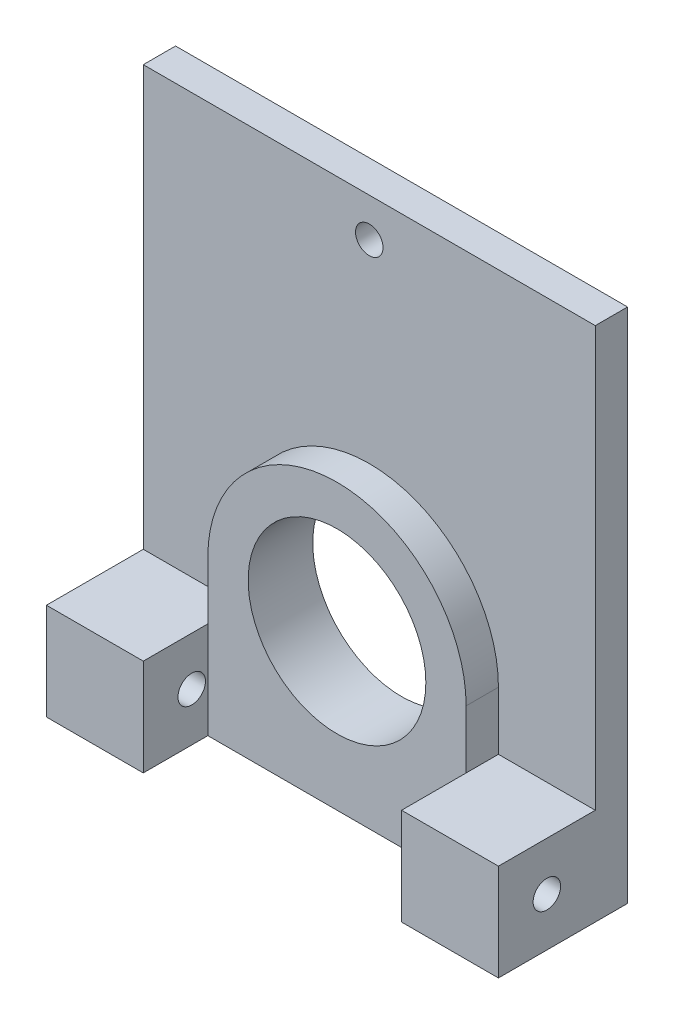
ISO-10303-21;
HEADER;
FILE_DESCRIPTION(('STEP AP214'),'2;1');
FILE_NAME('part.step','',(''),(''),'','','');
FILE_SCHEMA(('AUTOMOTIVE_DESIGN { 1 0 10303 214 1 1 1 1 }'));
ENDSEC;
DATA;
#1=APPLICATION_CONTEXT('core data for automotive mechanical design processes');
#2=APPLICATION_PROTOCOL_DEFINITION('international standard','automotive_design',2000,#1);
#3=PRODUCT_CONTEXT('',#1,'mechanical');
#4=PRODUCT('Part','Part','',(#3));
#5=PRODUCT_RELATED_PRODUCT_CATEGORY('part','',(#4));
#6=PRODUCT_DEFINITION_FORMATION('','',#4);
#7=PRODUCT_DEFINITION_CONTEXT('part definition',#1,'design');
#8=PRODUCT_DEFINITION('design','',#6,#7);
#9=PRODUCT_DEFINITION_SHAPE('','',#8);
#10=(LENGTH_UNIT() NAMED_UNIT(*) SI_UNIT(.MILLI.,.METRE.));
#11=(NAMED_UNIT(*) PLANE_ANGLE_UNIT() SI_UNIT($,.RADIAN.));
#12=(NAMED_UNIT(*) SI_UNIT($,.STERADIAN.) SOLID_ANGLE_UNIT());
#13=UNCERTAINTY_MEASURE_WITH_UNIT(LENGTH_MEASURE(1.E-05),#10,'distance_accuracy_value','');
#14=(GEOMETRIC_REPRESENTATION_CONTEXT(3) GLOBAL_UNCERTAINTY_ASSIGNED_CONTEXT((#13)) GLOBAL_UNIT_ASSIGNED_CONTEXT((#10,
#11,#12)) REPRESENTATION_CONTEXT('',''));
#15=CARTESIAN_POINT('',(0.,0.,0.));
#16=DIRECTION('',(0.,0.,1.));
#17=DIRECTION('',(1.,0.,0.));
#18=AXIS2_PLACEMENT_3D('',#15,#16,#17);
#19=CARTESIAN_POINT('',(0.,0.,3.175));
#20=DIRECTION('',(0.,0.,1.));
#21=DIRECTION('',(1.,0.,0.));
#22=AXIS2_PLACEMENT_3D('',#19,#20,#21);
#23=PLANE('',#22);
#24=CARTESIAN_POINT('',(0.,21.59,3.175));
#25=DIRECTION('',(0.,0.,1.));
#26=DIRECTION('',(1.,0.,0.));
#27=AXIS2_PLACEMENT_3D('',#24,#25,#26);
#28=CIRCLE('',#27,1.35255);
#29=CARTESIAN_POINT('',(1.35255,21.59,3.175));
#30=VERTEX_POINT('',#29);
#31=EDGE_CURVE('E327',#30,#30,#28,.T.);
#32=ORIENTED_EDGE('',*,*,#31,.F.);
#33=EDGE_LOOP('',(#32));
#34=FACE_BOUND('',#33,.T.);
#35=DIRECTION('',(0.,1.,0.));
#36=VECTOR('',#35,1.);
#37=CARTESIAN_POINT('',(12.7,-10.16,3.175));
#38=LINE('',#37,#36);
#39=CARTESIAN_POINT('',(12.7,-15.875,3.175));
#40=VERTEX_POINT('',#39);
#41=CARTESIAN_POINT('',(12.7,-10.16,3.175));
#42=VERTEX_POINT('',#41);
#43=EDGE_CURVE('E60',#40,#42,#38,.T.);
#44=ORIENTED_EDGE('',*,*,#43,.F.);
#45=DIRECTION('',(-1.,0.,0.));
#46=VECTOR('',#45,1.);
#47=CARTESIAN_POINT('',(22.225,-15.875,3.175));
#48=LINE('',#47,#46);
#49=CARTESIAN_POINT('',(22.225,-15.875,3.175));
#50=VERTEX_POINT('',#49);
#51=EDGE_CURVE('E161',#50,#40,#48,.T.);
#52=ORIENTED_EDGE('',*,*,#51,.F.);
#53=DIRECTION('',(0.,1.,0.));
#54=VECTOR('',#53,1.);
#55=CARTESIAN_POINT('',(22.225,25.4,3.175));
#56=LINE('',#55,#54);
#57=CARTESIAN_POINT('',(22.225,25.4,3.175));
#58=VERTEX_POINT('',#57);
#59=EDGE_CURVE('E224',#50,#58,#56,.T.);
#60=ORIENTED_EDGE('',*,*,#59,.T.);
#61=DIRECTION('',(-1.,0.,0.));
#62=VECTOR('',#61,1.);
#63=CARTESIAN_POINT('',(-22.225,25.4,3.175));
#64=LINE('',#63,#62);
#65=CARTESIAN_POINT('',(-22.225,25.4,3.175));
#66=VERTEX_POINT('',#65);
#67=EDGE_CURVE('E226',#58,#66,#64,.T.);
#68=ORIENTED_EDGE('',*,*,#67,.T.);
#69=DIRECTION('',(0.,-1.,0.));
#70=VECTOR('',#69,1.);
#71=CARTESIAN_POINT('',(-22.225,25.4,3.175));
#72=LINE('',#71,#70);
#73=CARTESIAN_POINT('',(-22.225,-15.875,3.175));
#74=VERTEX_POINT('',#73);
#75=EDGE_CURVE('E148',#66,#74,#72,.T.);
#76=ORIENTED_EDGE('',*,*,#75,.T.);
#77=DIRECTION('',(-1.,0.,0.));
#78=VECTOR('',#77,1.);
#79=CARTESIAN_POINT('',(-22.225,-15.875,3.175));
#80=LINE('',#79,#78);
#81=CARTESIAN_POINT('',(-12.7,-15.875,3.175));
#82=VERTEX_POINT('',#81);
#83=EDGE_CURVE('E176',#82,#74,#80,.T.);
#84=ORIENTED_EDGE('',*,*,#83,.F.);
#85=DIRECTION('',(0.,-1.,0.));
#86=VECTOR('',#85,1.);
#87=CARTESIAN_POINT('',(-12.7,-10.16,3.175));
#88=LINE('',#87,#86);
#89=CARTESIAN_POINT('',(-12.7,-10.16,3.175));
#90=VERTEX_POINT('',#89);
#91=EDGE_CURVE('E214',#90,#82,#88,.T.);
#92=ORIENTED_EDGE('',*,*,#91,.F.);
#93=CARTESIAN_POINT('',(0.,-10.16,3.175));
#94=DIRECTION('',(0.,0.,1.));
#95=DIRECTION('',(1.,0.,0.));
#96=AXIS2_PLACEMENT_3D('',#93,#94,#95);
#97=CIRCLE('',#96,12.7);
#98=EDGE_CURVE('E196',#42,#90,#97,.T.);
#99=ORIENTED_EDGE('',*,*,#98,.F.);
#100=EDGE_LOOP('',(#44,#52,#60,#68,#76,#84,#92,#99));
#101=FACE_BOUND('',#100,.T.);
#102=ADVANCED_FACE('F37',(#34,#101),#23,.T.);
#103=CARTESIAN_POINT('',(12.7,-10.16,6.35));
#104=DIRECTION('',(-1.,0.,0.));
#105=DIRECTION('',(0.,-1.,0.));
#106=AXIS2_PLACEMENT_3D('',#103,#104,#105);
#107=PLANE('',#106);
#108=DIRECTION('',(0.,0.,-1.));
#109=VECTOR('',#108,1.);
#110=CARTESIAN_POINT('',(12.7,-15.875,12.7));
#111=LINE('',#110,#109);
#112=CARTESIAN_POINT('',(12.7,-15.875,6.35));
#113=VERTEX_POINT('',#112);
#114=EDGE_CURVE('E173',#113,#40,#111,.T.);
#115=ORIENTED_EDGE('',*,*,#114,.T.);
#116=ORIENTED_EDGE('',*,*,#43,.T.);
#117=DIRECTION('',(0.,0.,-1.));
#118=VECTOR('',#117,1.);
#119=CARTESIAN_POINT('',(12.7,-10.16,6.35));
#120=LINE('',#119,#118);
#121=CARTESIAN_POINT('',(12.7,-10.16,6.35));
#122=VERTEX_POINT('',#121);
#123=EDGE_CURVE('E211',#122,#42,#120,.T.);
#124=ORIENTED_EDGE('',*,*,#123,.F.);
#125=DIRECTION('',(0.,1.,0.));
#126=VECTOR('',#125,1.);
#127=CARTESIAN_POINT('',(12.7,-10.16,6.35));
#128=LINE('',#127,#126);
#129=EDGE_CURVE('E207',#113,#122,#128,.T.);
#130=ORIENTED_EDGE('',*,*,#129,.F.);
#131=EDGE_LOOP('',(#115,#116,#124,#130));
#132=FACE_BOUND('',#131,.T.);
#133=ADVANCED_FACE('F254',(#132),#107,.F.);
#134=CARTESIAN_POINT('',(-12.7,-10.16,6.35));
#135=DIRECTION('',(1.,0.,0.));
#136=DIRECTION('',(0.,1.,0.));
#137=AXIS2_PLACEMENT_3D('',#134,#135,#136);
#138=PLANE('',#137);
#139=DIRECTION('',(0.,0.,-1.));
#140=VECTOR('',#139,1.);
#141=CARTESIAN_POINT('',(-12.7,-15.875,12.7));
#142=LINE('',#141,#140);
#143=CARTESIAN_POINT('',(-12.7,-15.875,6.35));
#144=VERTEX_POINT('',#143);
#145=EDGE_CURVE('E190',#144,#82,#142,.T.);
#146=ORIENTED_EDGE('',*,*,#145,.F.);
#147=DIRECTION('',(0.,-1.,0.));
#148=VECTOR('',#147,1.);
#149=CARTESIAN_POINT('',(-12.7,-10.16,6.35));
#150=LINE('',#149,#148);
#151=CARTESIAN_POINT('',(-12.7,-10.16,6.35));
#152=VERTEX_POINT('',#151);
#153=EDGE_CURVE('E201',#152,#144,#150,.T.);
#154=ORIENTED_EDGE('',*,*,#153,.F.);
#155=DIRECTION('',(0.,0.,-1.));
#156=VECTOR('',#155,1.);
#157=CARTESIAN_POINT('',(-12.7,-10.16,6.35));
#158=LINE('',#157,#156);
#159=EDGE_CURVE('E220',#152,#90,#158,.T.);
#160=ORIENTED_EDGE('',*,*,#159,.T.);
#161=ORIENTED_EDGE('',*,*,#91,.T.);
#162=EDGE_LOOP('',(#146,#154,#160,#161));
#163=FACE_BOUND('',#162,.T.);
#164=ADVANCED_FACE('F276',(#163),#138,.F.);
#165=CARTESIAN_POINT('',(22.225,25.4,3.175));
#166=DIRECTION('',(-1.,0.,0.));
#167=DIRECTION('',(0.,-1.,0.));
#168=AXIS2_PLACEMENT_3D('',#165,#166,#167);
#169=PLANE('',#168);
#170=CARTESIAN_POINT('',(22.225,-20.6375,7.9375));
#171=DIRECTION('',(1.,0.,0.));
#172=DIRECTION('',(0.,0.,-1.));
#173=AXIS2_PLACEMENT_3D('',#170,#171,#172);
#174=CIRCLE('',#173,1.35255);
#175=CARTESIAN_POINT('',(22.225,-20.6375,6.58495000000001));
#176=VERTEX_POINT('',#175);
#177=EDGE_CURVE('E314',#176,#176,#174,.T.);
#178=ORIENTED_EDGE('',*,*,#177,.F.);
#179=EDGE_LOOP('',(#178));
#180=FACE_BOUND('',#179,.T.);
#181=DIRECTION('',(0.,1.,0.));
#182=VECTOR('',#181,1.);
#183=CARTESIAN_POINT('',(22.225,25.4,0.));
#184=LINE('',#183,#182);
#185=CARTESIAN_POINT('',(22.225,-25.4,0.));
#186=VERTEX_POINT('',#185);
#187=CARTESIAN_POINT('',(22.225,25.4,0.));
#188=VERTEX_POINT('',#187);
#189=EDGE_CURVE('E223',#186,#188,#184,.T.);
#190=ORIENTED_EDGE('',*,*,#189,.T.);
#191=DIRECTION('',(0.,0.,-1.));
#192=VECTOR('',#191,1.);
#193=CARTESIAN_POINT('',(22.225,25.4,3.175));
#194=LINE('',#193,#192);
#195=EDGE_CURVE('E11',#58,#188,#194,.T.);
#196=ORIENTED_EDGE('',*,*,#195,.F.);
#197=ORIENTED_EDGE('',*,*,#59,.F.);
#198=DIRECTION('',(0.,0.,-1.));
#199=VECTOR('',#198,1.);
#200=CARTESIAN_POINT('',(22.225,-15.875,12.7));
#201=LINE('',#200,#199);
#202=CARTESIAN_POINT('',(22.225,-15.875,12.7));
#203=VERTEX_POINT('',#202);
#204=EDGE_CURVE('E153',#203,#50,#201,.T.);
#205=ORIENTED_EDGE('',*,*,#204,.F.);
#206=DIRECTION('',(0.,1.,0.));
#207=VECTOR('',#206,1.);
#208=CARTESIAN_POINT('',(22.225,-25.4,12.7));
#209=LINE('',#208,#207);
#210=CARTESIAN_POINT('',(22.225,-25.4,12.7));
#211=VERTEX_POINT('',#210);
#212=EDGE_CURVE('E151',#211,#203,#209,.T.);
#213=ORIENTED_EDGE('',*,*,#212,.F.);
#214=DIRECTION('',(0.,0.,-1.));
#215=VECTOR('',#214,1.);
#216=CARTESIAN_POINT('',(22.225,-25.4,3.175));
#217=LINE('',#216,#215);
#218=EDGE_CURVE('E135',#211,#186,#217,.T.);
#219=ORIENTED_EDGE('',*,*,#218,.T.);
#220=EDGE_LOOP('',(#190,#196,#197,#205,#213,#219));
#221=FACE_BOUND('',#220,.T.);
#222=ADVANCED_FACE('F39',(#180,#221),#169,.F.);
#223=CARTESIAN_POINT('',(-22.225,25.4,3.175));
#224=DIRECTION('',(0.,-1.,0.));
#225=DIRECTION('',(0.,0.,-1.));
#226=AXIS2_PLACEMENT_3D('',#223,#224,#225);
#227=PLANE('',#226);
#228=DIRECTION('',(-1.,0.,0.));
#229=VECTOR('',#228,1.);
#230=CARTESIAN_POINT('',(-22.225,25.4,0.));
#231=LINE('',#230,#229);
#232=CARTESIAN_POINT('',(-22.225,25.4,0.));
#233=VERTEX_POINT('',#232);
#234=EDGE_CURVE('E231',#188,#233,#231,.T.);
#235=ORIENTED_EDGE('',*,*,#234,.T.);
#236=DIRECTION('',(0.,0.,-1.));
#237=VECTOR('',#236,1.);
#238=CARTESIAN_POINT('',(-22.225,25.4,3.175));
#239=LINE('',#238,#237);
#240=EDGE_CURVE('E45',#66,#233,#239,.T.);
#241=ORIENTED_EDGE('',*,*,#240,.F.);
#242=ORIENTED_EDGE('',*,*,#67,.F.);
#243=ORIENTED_EDGE('',*,*,#195,.T.);
#244=EDGE_LOOP('',(#235,#241,#242,#243));
#245=FACE_BOUND('',#244,.T.);
#246=ADVANCED_FACE('F247',(#245),#227,.F.);
#247=CARTESIAN_POINT('',(-22.225,25.4,3.175));
#248=DIRECTION('',(1.,0.,0.));
#249=DIRECTION('',(0.,1.,0.));
#250=AXIS2_PLACEMENT_3D('',#247,#248,#249);
#251=PLANE('',#250);
#252=CARTESIAN_POINT('',(-22.225,-20.6375,7.9375));
#253=DIRECTION('',(-1.,0.,0.));
#254=DIRECTION('',(0.,0.,1.));
#255=AXIS2_PLACEMENT_3D('',#252,#253,#254);
#256=CIRCLE('',#255,1.35255);
#257=CARTESIAN_POINT('',(-22.225,-20.6375,9.29005));
#258=VERTEX_POINT('',#257);
#259=EDGE_CURVE('E319',#258,#258,#256,.T.);
#260=ORIENTED_EDGE('',*,*,#259,.F.);
#261=EDGE_LOOP('',(#260));
#262=FACE_BOUND('',#261,.T.);
#263=DIRECTION('',(0.,-1.,0.));
#264=VECTOR('',#263,1.);
#265=CARTESIAN_POINT('',(-22.225,25.4,0.));
#266=LINE('',#265,#264);
#267=CARTESIAN_POINT('',(-22.225,-25.4,0.));
#268=VERTEX_POINT('',#267);
#269=EDGE_CURVE('E233',#233,#268,#266,.T.);
#270=ORIENTED_EDGE('',*,*,#269,.T.);
#271=DIRECTION('',(0.,0.,-1.));
#272=VECTOR('',#271,1.);
#273=CARTESIAN_POINT('',(-22.225,-25.4,3.175));
#274=LINE('',#273,#272);
#275=CARTESIAN_POINT('',(-22.225,-25.4,12.7));
#276=VERTEX_POINT('',#275);
#277=EDGE_CURVE('E147',#276,#268,#274,.T.);
#278=ORIENTED_EDGE('',*,*,#277,.F.);
#279=DIRECTION('',(0.,-1.,0.));
#280=VECTOR('',#279,1.);
#281=CARTESIAN_POINT('',(-22.225,-25.4,12.7));
#282=LINE('',#281,#280);
#283=CARTESIAN_POINT('',(-22.225,-15.875,12.7));
#284=VERTEX_POINT('',#283);
#285=EDGE_CURVE('E177',#284,#276,#282,.T.);
#286=ORIENTED_EDGE('',*,*,#285,.F.);
#287=DIRECTION('',(0.,0.,-1.));
#288=VECTOR('',#287,1.);
#289=CARTESIAN_POINT('',(-22.225,-15.875,12.7));
#290=LINE('',#289,#288);
#291=EDGE_CURVE('E186',#284,#74,#290,.T.);
#292=ORIENTED_EDGE('',*,*,#291,.T.);
#293=ORIENTED_EDGE('',*,*,#75,.F.);
#294=ORIENTED_EDGE('',*,*,#240,.T.);
#295=EDGE_LOOP('',(#270,#278,#286,#292,#293,#294));
#296=FACE_BOUND('',#295,.T.);
#297=ADVANCED_FACE('F241',(#262,#296),#251,.F.);
#298=CARTESIAN_POINT('',(-22.225,-25.4,3.175));
#299=DIRECTION('',(0.,1.,0.));
#300=DIRECTION('',(0.,0.,1.));
#301=AXIS2_PLACEMENT_3D('',#298,#299,#300);
#302=PLANE('',#301);
#303=ORIENTED_EDGE('',*,*,#218,.F.);
#304=DIRECTION('',(1.,0.,0.));
#305=VECTOR('',#304,1.);
#306=CARTESIAN_POINT('',(22.225,-25.4,12.7));
#307=LINE('',#306,#305);
#308=CARTESIAN_POINT('',(12.7,-25.4,12.7));
#309=VERTEX_POINT('',#308);
#310=EDGE_CURVE('E140',#309,#211,#307,.T.);
#311=ORIENTED_EDGE('',*,*,#310,.F.);
#312=DIRECTION('',(0.,0.,-1.));
#313=VECTOR('',#312,1.);
#314=CARTESIAN_POINT('',(12.7,-25.4,12.7));
#315=LINE('',#314,#313);
#316=CARTESIAN_POINT('',(12.7,-25.4,6.35));
#317=VERTEX_POINT('',#316);
#318=EDGE_CURVE('E170',#309,#317,#315,.T.);
#319=ORIENTED_EDGE('',*,*,#318,.T.);
#320=DIRECTION('',(1.,0.,0.));
#321=VECTOR('',#320,1.);
#322=CARTESIAN_POINT('',(-12.7,-25.4,6.35));
#323=LINE('',#322,#321);
#324=CARTESIAN_POINT('',(-12.7,-25.4,6.35));
#325=VERTEX_POINT('',#324);
#326=EDGE_CURVE('E204',#325,#317,#323,.T.);
#327=ORIENTED_EDGE('',*,*,#326,.F.);
#328=DIRECTION('',(0.,0.,-1.));
#329=VECTOR('',#328,1.);
#330=CARTESIAN_POINT('',(-12.7,-25.4,12.7));
#331=LINE('',#330,#329);
#332=CARTESIAN_POINT('',(-12.7,-25.4,12.7));
#333=VERTEX_POINT('',#332);
#334=EDGE_CURVE('E194',#333,#325,#331,.T.);
#335=ORIENTED_EDGE('',*,*,#334,.F.);
#336=DIRECTION('',(1.,0.,0.));
#337=VECTOR('',#336,1.);
#338=CARTESIAN_POINT('',(-22.225,-25.4,12.7));
#339=LINE('',#338,#337);
#340=EDGE_CURVE('E180',#276,#333,#339,.T.);
#341=ORIENTED_EDGE('',*,*,#340,.F.);
#342=ORIENTED_EDGE('',*,*,#277,.T.);
#343=DIRECTION('',(1.,0.,0.));
#344=VECTOR('',#343,1.);
#345=CARTESIAN_POINT('',(-22.225,-25.4,0.));
#346=LINE('',#345,#344);
#347=EDGE_CURVE('E143',#268,#186,#346,.T.);
#348=ORIENTED_EDGE('',*,*,#347,.T.);
#349=EDGE_LOOP('',(#303,#311,#319,#327,#335,#341,#342,#348));
#350=FACE_BOUND('',#349,.T.);
#351=ADVANCED_FACE('F137',(#350),#302,.F.);
#352=CARTESIAN_POINT('',(0.,0.,0.));
#353=DIRECTION('',(0.,0.,1.));
#354=DIRECTION('',(1.,0.,0.));
#355=AXIS2_PLACEMENT_3D('',#352,#353,#354);
#356=PLANE('',#355);
#357=CARTESIAN_POINT('',(0.,21.59,0.));
#358=DIRECTION('',(0.,0.,1.));
#359=DIRECTION('',(1.,0.,0.));
#360=AXIS2_PLACEMENT_3D('',#357,#358,#359);
#361=CIRCLE('',#360,1.35255);
#362=CARTESIAN_POINT('',(1.35255,21.59,0.));
#363=VERTEX_POINT('',#362);
#364=EDGE_CURVE('E330',#363,#363,#361,.T.);
#365=ORIENTED_EDGE('',*,*,#364,.T.);
#366=EDGE_LOOP('',(#365));
#367=FACE_BOUND('',#366,.T.);
#368=CARTESIAN_POINT('',(0.,-10.16,0.));
#369=DIRECTION('',(0.,0.,1.));
#370=DIRECTION('',(1.,0.,0.));
#371=AXIS2_PLACEMENT_3D('',#368,#369,#370);
#372=CIRCLE('',#371,8.7376);
#373=CARTESIAN_POINT('',(8.7376,-10.16,0.));
#374=VERTEX_POINT('',#373);
#375=EDGE_CURVE('E163',#374,#374,#372,.T.);
#376=ORIENTED_EDGE('',*,*,#375,.T.);
#377=EDGE_LOOP('',(#376));
#378=FACE_BOUND('',#377,.T.);
#379=ORIENTED_EDGE('',*,*,#189,.F.);
#380=ORIENTED_EDGE('',*,*,#347,.F.);
#381=ORIENTED_EDGE('',*,*,#269,.F.);
#382=ORIENTED_EDGE('',*,*,#234,.F.);
#383=EDGE_LOOP('',(#379,#380,#381,#382));
#384=FACE_BOUND('',#383,.T.);
#385=ADVANCED_FACE('F245',(#367,#378,#384),#356,.F.);
#386=CARTESIAN_POINT('',(0.,-10.16,6.35));
#387=DIRECTION('',(0.,0.,-1.));
#388=DIRECTION('',(-1.,0.,0.));
#389=AXIS2_PLACEMENT_3D('',#386,#387,#388);
#390=CYLINDRICAL_SURFACE('',#389,12.7);
#391=ORIENTED_EDGE('',*,*,#98,.T.);
#392=ORIENTED_EDGE('',*,*,#159,.F.);
#393=CARTESIAN_POINT('',(0.,-10.16,6.35));
#394=DIRECTION('',(0.,0.,1.));
#395=DIRECTION('',(1.,0.,0.));
#396=AXIS2_PLACEMENT_3D('',#393,#394,#395);
#397=CIRCLE('',#396,12.7);
#398=EDGE_CURVE('E197',#122,#152,#397,.T.);
#399=ORIENTED_EDGE('',*,*,#398,.F.);
#400=ORIENTED_EDGE('',*,*,#123,.T.);
#401=EDGE_LOOP('',(#391,#392,#399,#400));
#402=FACE_BOUND('',#401,.T.);
#403=ADVANCED_FACE('F279',(#402),#390,.T.);
#404=CARTESIAN_POINT('',(0.,-10.16,6.35));
#405=DIRECTION('',(0.,0.,1.));
#406=DIRECTION('',(1.,0.,0.));
#407=AXIS2_PLACEMENT_3D('',#404,#405,#406);
#408=PLANE('',#407);
#409=CARTESIAN_POINT('',(0.,-10.16,6.35));
#410=DIRECTION('',(0.,0.,1.));
#411=DIRECTION('',(1.,0.,0.));
#412=AXIS2_PLACEMENT_3D('',#409,#410,#411);
#413=CIRCLE('',#412,8.7376);
#414=CARTESIAN_POINT('',(8.7376,-10.16,6.35));
#415=VERTEX_POINT('',#414);
#416=EDGE_CURVE('E166',#415,#415,#413,.T.);
#417=ORIENTED_EDGE('',*,*,#416,.F.);
#418=EDGE_LOOP('',(#417));
#419=FACE_BOUND('',#418,.T.);
#420=ORIENTED_EDGE('',*,*,#398,.T.);
#421=ORIENTED_EDGE('',*,*,#153,.T.);
#422=EDGE_CURVE('E200',#144,#325,#150,.T.);
#423=ORIENTED_EDGE('',*,*,#422,.T.);
#424=ORIENTED_EDGE('',*,*,#326,.T.);
#425=EDGE_CURVE('E208',#317,#113,#128,.T.);
#426=ORIENTED_EDGE('',*,*,#425,.T.);
#427=ORIENTED_EDGE('',*,*,#129,.T.);
#428=EDGE_LOOP('',(#420,#421,#423,#424,#426,#427));
#429=FACE_BOUND('',#428,.T.);
#430=ADVANCED_FACE('F257',(#419,#429),#408,.T.);
#431=CARTESIAN_POINT('',(-12.7,-25.4,12.7));
#432=DIRECTION('',(-1.,0.,0.));
#433=DIRECTION('',(0.,0.,1.));
#434=AXIS2_PLACEMENT_3D('',#431,#432,#433);
#435=PLANE('',#434);
#436=CARTESIAN_POINT('',(-12.7,-20.6375,7.9375));
#437=DIRECTION('',(-1.,0.,0.));
#438=DIRECTION('',(0.,0.,1.));
#439=AXIS2_PLACEMENT_3D('',#436,#437,#438);
#440=CIRCLE('',#439,1.35255);
#441=CARTESIAN_POINT('',(-12.7,-20.6375,9.29005));
#442=VERTEX_POINT('',#441);
#443=EDGE_CURVE('E324',#442,#442,#440,.T.);
#444=ORIENTED_EDGE('',*,*,#443,.T.);
#445=EDGE_LOOP('',(#444));
#446=FACE_BOUND('',#445,.T.);
#447=ORIENTED_EDGE('',*,*,#422,.F.);
#448=CARTESIAN_POINT('',(-12.7,-15.875,12.7));
#449=VERTEX_POINT('',#448);
#450=EDGE_CURVE('E191',#449,#144,#142,.T.);
#451=ORIENTED_EDGE('',*,*,#450,.F.);
#452=DIRECTION('',(0.,1.,0.));
#453=VECTOR('',#452,1.);
#454=CARTESIAN_POINT('',(-12.7,-25.4,12.7));
#455=LINE('',#454,#453);
#456=EDGE_CURVE('E182',#333,#449,#455,.T.);
#457=ORIENTED_EDGE('',*,*,#456,.F.);
#458=ORIENTED_EDGE('',*,*,#334,.T.);
#459=EDGE_LOOP('',(#447,#451,#457,#458));
#460=FACE_BOUND('',#459,.T.);
#461=ADVANCED_FACE('F266',(#446,#460),#435,.F.);
#462=CARTESIAN_POINT('',(-22.225,-15.875,12.7));
#463=DIRECTION('',(0.,-1.,0.));
#464=DIRECTION('',(0.,0.,-1.));
#465=AXIS2_PLACEMENT_3D('',#462,#463,#464);
#466=PLANE('',#465);
#467=ORIENTED_EDGE('',*,*,#83,.T.);
#468=ORIENTED_EDGE('',*,*,#291,.F.);
#469=DIRECTION('',(-1.,0.,0.));
#470=VECTOR('',#469,1.);
#471=CARTESIAN_POINT('',(-22.225,-15.875,12.7));
#472=LINE('',#471,#470);
#473=EDGE_CURVE('E184',#449,#284,#472,.T.);
#474=ORIENTED_EDGE('',*,*,#473,.F.);
#475=ORIENTED_EDGE('',*,*,#450,.T.);
#476=ORIENTED_EDGE('',*,*,#145,.T.);
#477=EDGE_LOOP('',(#467,#468,#474,#475,#476));
#478=FACE_BOUND('',#477,.T.);
#479=ADVANCED_FACE('F273',(#478),#466,.F.);
#480=CARTESIAN_POINT('',(0.,0.,12.7));
#481=DIRECTION('',(0.,0.,-1.));
#482=DIRECTION('',(-1.,0.,0.));
#483=AXIS2_PLACEMENT_3D('',#480,#481,#482);
#484=PLANE('',#483);
#485=ORIENTED_EDGE('',*,*,#285,.T.);
#486=ORIENTED_EDGE('',*,*,#340,.T.);
#487=ORIENTED_EDGE('',*,*,#456,.T.);
#488=ORIENTED_EDGE('',*,*,#473,.T.);
#489=EDGE_LOOP('',(#485,#486,#487,#488));
#490=FACE_BOUND('',#489,.T.);
#491=ADVANCED_FACE('F269',(#490),#484,.F.);
#492=CARTESIAN_POINT('',(22.225,-15.875,12.7));
#493=DIRECTION('',(0.,-1.,0.));
#494=DIRECTION('',(1.,0.,0.));
#495=AXIS2_PLACEMENT_3D('',#492,#493,#494);
#496=PLANE('',#495);
#497=ORIENTED_EDGE('',*,*,#51,.T.);
#498=ORIENTED_EDGE('',*,*,#114,.F.);
#499=CARTESIAN_POINT('',(12.7,-15.875,12.7));
#500=VERTEX_POINT('',#499);
#501=EDGE_CURVE('E52',#500,#113,#111,.T.);
#502=ORIENTED_EDGE('',*,*,#501,.F.);
#503=DIRECTION('',(-1.,0.,0.));
#504=VECTOR('',#503,1.);
#505=CARTESIAN_POINT('',(22.225,-15.875,12.7));
#506=LINE('',#505,#504);
#507=EDGE_CURVE('E156',#203,#500,#506,.T.);
#508=ORIENTED_EDGE('',*,*,#507,.F.);
#509=ORIENTED_EDGE('',*,*,#204,.T.);
#510=EDGE_LOOP('',(#497,#498,#502,#508,#509));
#511=FACE_BOUND('',#510,.T.);
#512=ADVANCED_FACE('F252',(#511),#496,.F.);
#513=CARTESIAN_POINT('',(12.7,-25.4,12.7));
#514=DIRECTION('',(1.,0.,0.));
#515=DIRECTION('',(0.,1.,0.));
#516=AXIS2_PLACEMENT_3D('',#513,#514,#515);
#517=PLANE('',#516);
#518=CARTESIAN_POINT('',(12.7,-20.6375,7.9375));
#519=DIRECTION('',(1.,0.,0.));
#520=DIRECTION('',(0.,1.,0.));
#521=AXIS2_PLACEMENT_3D('',#518,#519,#520);
#522=CIRCLE('',#521,1.35255);
#523=CARTESIAN_POINT('',(12.7,-19.28495,7.9375));
#524=VERTEX_POINT('',#523);
#525=EDGE_CURVE('E316',#524,#524,#522,.T.);
#526=ORIENTED_EDGE('',*,*,#525,.T.);
#527=EDGE_LOOP('',(#526));
#528=FACE_BOUND('',#527,.T.);
#529=ORIENTED_EDGE('',*,*,#425,.F.);
#530=ORIENTED_EDGE('',*,*,#318,.F.);
#531=DIRECTION('',(0.,-1.,0.));
#532=VECTOR('',#531,1.);
#533=CARTESIAN_POINT('',(12.7,-25.4,12.7));
#534=LINE('',#533,#532);
#535=EDGE_CURVE('E159',#500,#309,#534,.T.);
#536=ORIENTED_EDGE('',*,*,#535,.F.);
#537=ORIENTED_EDGE('',*,*,#501,.T.);
#538=EDGE_LOOP('',(#529,#530,#536,#537));
#539=FACE_BOUND('',#538,.T.);
#540=ADVANCED_FACE('F260',(#528,#539),#517,.F.);
#541=CARTESIAN_POINT('',(0.,0.,12.7));
#542=DIRECTION('',(0.,0.,-1.));
#543=DIRECTION('',(-1.,0.,0.));
#544=AXIS2_PLACEMENT_3D('',#541,#542,#543);
#545=PLANE('',#544);
#546=ORIENTED_EDGE('',*,*,#310,.T.);
#547=ORIENTED_EDGE('',*,*,#212,.T.);
#548=ORIENTED_EDGE('',*,*,#507,.T.);
#549=ORIENTED_EDGE('',*,*,#535,.T.);
#550=EDGE_LOOP('',(#546,#547,#548,#549));
#551=FACE_BOUND('',#550,.T.);
#552=ADVANCED_FACE('F158',(#551),#545,.F.);
#553=CARTESIAN_POINT('',(0.,-10.16,0.));
#554=DIRECTION('',(0.,0.,1.));
#555=DIRECTION('',(1.,0.,0.));
#556=AXIS2_PLACEMENT_3D('',#553,#554,#555);
#557=CYLINDRICAL_SURFACE('',#556,8.7376);
#558=ORIENTED_EDGE('',*,*,#375,.F.);
#559=EDGE_LOOP('',(#558));
#560=FACE_BOUND('',#559,.T.);
#561=ORIENTED_EDGE('',*,*,#416,.T.);
#562=EDGE_LOOP('',(#561));
#563=FACE_BOUND('',#562,.T.);
#564=ADVANCED_FACE('F338',(#560,#563),#557,.F.);
#565=CARTESIAN_POINT('',(0.,21.59,3.175));
#566=DIRECTION('',(0.,0.,1.));
#567=DIRECTION('',(1.,0.,0.));
#568=AXIS2_PLACEMENT_3D('',#565,#566,#567);
#569=CYLINDRICAL_SURFACE('',#568,1.35255);
#570=ORIENTED_EDGE('',*,*,#364,.F.);
#571=EDGE_LOOP('',(#570));
#572=FACE_BOUND('',#571,.T.);
#573=ORIENTED_EDGE('',*,*,#31,.T.);
#574=EDGE_LOOP('',(#573));
#575=FACE_BOUND('',#574,.T.);
#576=ADVANCED_FACE('F340',(#572,#575),#569,.F.);
#577=CARTESIAN_POINT('',(-22.225,-20.6375,7.9375));
#578=DIRECTION('',(-1.,0.,0.));
#579=DIRECTION('',(0.,0.,1.));
#580=AXIS2_PLACEMENT_3D('',#577,#578,#579);
#581=CYLINDRICAL_SURFACE('',#580,1.35255);
#582=ORIENTED_EDGE('',*,*,#443,.F.);
#583=EDGE_LOOP('',(#582));
#584=FACE_BOUND('',#583,.T.);
#585=ORIENTED_EDGE('',*,*,#259,.T.);
#586=EDGE_LOOP('',(#585));
#587=FACE_BOUND('',#586,.T.);
#588=ADVANCED_FACE('F347',(#584,#587),#581,.F.);
#589=CARTESIAN_POINT('',(22.225,-20.6375,7.9375));
#590=DIRECTION('',(1.,0.,0.));
#591=DIRECTION('',(0.,0.,-1.));
#592=AXIS2_PLACEMENT_3D('',#589,#590,#591);
#593=CYLINDRICAL_SURFACE('',#592,1.35255);
#594=ORIENTED_EDGE('',*,*,#525,.F.);
#595=EDGE_LOOP('',(#594));
#596=FACE_BOUND('',#595,.T.);
#597=ORIENTED_EDGE('',*,*,#177,.T.);
#598=EDGE_LOOP('',(#597));
#599=FACE_BOUND('',#598,.T.);
#600=ADVANCED_FACE('F370',(#596,#599),#593,.F.);
#601=CLOSED_SHELL('',(#102,#133,#164,#222,#246,#297,#351,#385,#403,#430,#461,#479,#491,#512,
#540,#552,#564,#576,#588,#600));
#602=MANIFOLD_SOLID_BREP('B2',#601);
#603=ADVANCED_BREP_SHAPE_REPRESENTATION('',(#18,#602),#14);
#604=SHAPE_DEFINITION_REPRESENTATION(#9,#603);
ENDSEC;
END-ISO-10303-21;
